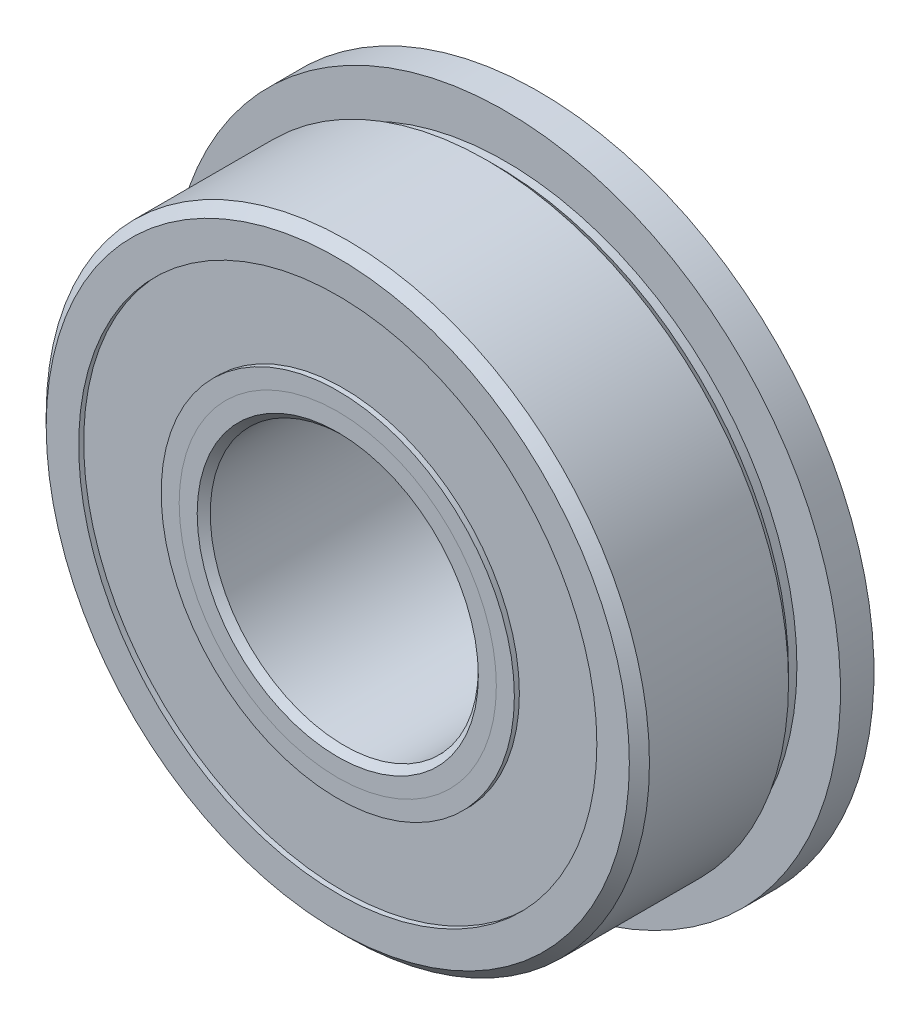
ISO-10303-21;
HEADER;
FILE_DESCRIPTION(('STEP AP214'),'2;1');
FILE_NAME('part.step','',(''),(''),'','','');
FILE_SCHEMA(('AUTOMOTIVE_DESIGN { 1 0 10303 214 1 1 1 1 }'));
ENDSEC;
DATA;
#1=APPLICATION_CONTEXT('core data for automotive mechanical design processes');
#2=APPLICATION_PROTOCOL_DEFINITION('international standard','automotive_design',2000,#1);
#3=PRODUCT_CONTEXT('',#1,'mechanical');
#4=PRODUCT('Part','Part','',(#3));
#5=PRODUCT_RELATED_PRODUCT_CATEGORY('part','',(#4));
#6=PRODUCT_DEFINITION_FORMATION('','',#4);
#7=PRODUCT_DEFINITION_CONTEXT('part definition',#1,'design');
#8=PRODUCT_DEFINITION('design','',#6,#7);
#9=PRODUCT_DEFINITION_SHAPE('','',#8);
#10=(LENGTH_UNIT() NAMED_UNIT(*) SI_UNIT(.MILLI.,.METRE.));
#11=(NAMED_UNIT(*) PLANE_ANGLE_UNIT() SI_UNIT($,.RADIAN.));
#12=(NAMED_UNIT(*) SI_UNIT($,.STERADIAN.) SOLID_ANGLE_UNIT());
#13=UNCERTAINTY_MEASURE_WITH_UNIT(LENGTH_MEASURE(1.E-05),#10,'distance_accuracy_value','');
#14=(GEOMETRIC_REPRESENTATION_CONTEXT(3) GLOBAL_UNCERTAINTY_ASSIGNED_CONTEXT((#13)) GLOBAL_UNIT_ASSIGNED_CONTEXT((#10,
#11,#12)) REPRESENTATION_CONTEXT('',''));
#15=CARTESIAN_POINT('',(0.,0.,0.));
#16=DIRECTION('',(0.,0.,1.));
#17=DIRECTION('',(1.,0.,0.));
#18=AXIS2_PLACEMENT_3D('',#15,#16,#17);
#19=CARTESIAN_POINT('',(0.,0.,4.7625));
#20=DIRECTION('',(0.,0.,1.));
#21=DIRECTION('',(1.,0.,0.));
#22=AXIS2_PLACEMENT_3D('',#19,#20,#21);
#23=CYLINDRICAL_SURFACE('',#22,8.7376);
#24=CARTESIAN_POINT('',(0.,0.,-3.35017734788581));
#25=DIRECTION('',(0.,0.,1.));
#26=DIRECTION('',(1.,0.,0.));
#27=AXIS2_PLACEMENT_3D('',#24,#25,#26);
#28=CIRCLE('',#27,8.7376);
#29=CARTESIAN_POINT('',(8.7376,0.,-3.35017734788581));
#30=VERTEX_POINT('',#29);
#31=EDGE_CURVE('E11',#30,#30,#28,.T.);
#32=ORIENTED_EDGE('',*,*,#31,.T.);
#33=EDGE_LOOP('',(#32));
#34=FACE_BOUND('',#33,.T.);
#35=CARTESIAN_POINT('',(0.,0.,-4.270375));
#36=DIRECTION('',(0.,0.,-1.));
#37=DIRECTION('',(-1.,0.,0.));
#38=AXIS2_PLACEMENT_3D('',#35,#36,#37);
#39=CIRCLE('',#38,8.7376);
#40=CARTESIAN_POINT('',(-8.7376,0.,-4.270375));
#41=VERTEX_POINT('',#40);
#42=EDGE_CURVE('E75',#41,#41,#39,.T.);
#43=ORIENTED_EDGE('',*,*,#42,.T.);
#44=EDGE_LOOP('',(#43));
#45=FACE_BOUND('',#44,.T.);
#46=ADVANCED_FACE('F54',(#34,#45),#23,.F.);
#47=CARTESIAN_POINT('',(0.,12.2725961538462,-4.524375));
#48=DIRECTION('',(0.,0.,1.));
#49=DIRECTION('',(1.,0.,0.));
#50=AXIS2_PLACEMENT_3D('',#47,#48,#49);
#51=PLANE('',#50);
#52=CARTESIAN_POINT('',(0.,0.,-4.524375));
#53=DIRECTION('',(0.,0.,-1.));
#54=DIRECTION('',(-1.,0.,0.));
#55=AXIS2_PLACEMENT_3D('',#52,#53,#54);
#56=CIRCLE('',#55,9.436608);
#57=CARTESIAN_POINT('',(-9.436608,0.,-4.524375));
#58=VERTEX_POINT('',#57);
#59=EDGE_CURVE('E72',#58,#58,#56,.T.);
#60=ORIENTED_EDGE('',*,*,#59,.F.);
#61=EDGE_LOOP('',(#60));
#62=FACE_BOUND('',#61,.T.);
#63=CARTESIAN_POINT('',(0.,0.,-4.524375));
#64=DIRECTION('',(0.,0.,1.));
#65=DIRECTION('',(1.,0.,0.));
#66=AXIS2_PLACEMENT_3D('',#63,#64,#65);
#67=CIRCLE('',#66,12.2725961538462);
#68=CARTESIAN_POINT('',(12.2725961538462,0.,-4.524375));
#69=VERTEX_POINT('',#68);
#70=EDGE_CURVE('E65',#69,#69,#67,.T.);
#71=ORIENTED_EDGE('',*,*,#70,.F.);
#72=EDGE_LOOP('',(#71));
#73=FACE_BOUND('',#72,.T.);
#74=ADVANCED_FACE('F56',(#62,#73),#51,.F.);
#75=CARTESIAN_POINT('',(0.,12.2725961538462,-3.35017734788581));
#76=DIRECTION('',(0.,0.,-1.));
#77=DIRECTION('',(-1.,0.,0.));
#78=AXIS2_PLACEMENT_3D('',#75,#76,#77);
#79=PLANE('',#78);
#80=ORIENTED_EDGE('',*,*,#31,.F.);
#81=EDGE_LOOP('',(#80));
#82=FACE_BOUND('',#81,.T.);
#83=CARTESIAN_POINT('',(0.,0.,-3.35017734788581));
#84=DIRECTION('',(0.,0.,1.));
#85=DIRECTION('',(1.,0.,0.));
#86=AXIS2_PLACEMENT_3D('',#83,#84,#85);
#87=CIRCLE('',#86,12.2725961538462);
#88=CARTESIAN_POINT('',(12.2725961538462,0.,-3.35017734788581));
#89=VERTEX_POINT('',#88);
#90=EDGE_CURVE('E61',#89,#89,#87,.T.);
#91=ORIENTED_EDGE('',*,*,#90,.T.);
#92=EDGE_LOOP('',(#91));
#93=FACE_BOUND('',#92,.T.);
#94=ADVANCED_FACE('F97',(#82,#93),#79,.F.);
#95=CARTESIAN_POINT('',(0.,0.,4.7625));
#96=DIRECTION('',(0.,0.,1.));
#97=DIRECTION('',(1.,0.,0.));
#98=AXIS2_PLACEMENT_3D('',#95,#96,#97);
#99=CYLINDRICAL_SURFACE('',#98,12.2725961538462);
#100=ORIENTED_EDGE('',*,*,#90,.F.);
#101=EDGE_LOOP('',(#100));
#102=FACE_BOUND('',#101,.T.);
#103=ORIENTED_EDGE('',*,*,#70,.T.);
#104=EDGE_LOOP('',(#103));
#105=FACE_BOUND('',#104,.T.);
#106=ADVANCED_FACE('F91',(#102,#105),#99,.T.);
#107=CARTESIAN_POINT('',(0.,0.,-4.270375));
#108=DIRECTION('',(0.,0.,-1.));
#109=DIRECTION('',(-1.,0.,0.));
#110=AXIS2_PLACEMENT_3D('',#107,#108,#109);
#111=CYLINDRICAL_SURFACE('',#110,9.436608);
#112=CARTESIAN_POINT('',(0.,0.,-4.270375));
#113=DIRECTION('',(0.,0.,-1.));
#114=DIRECTION('',(-1.,0.,0.));
#115=AXIS2_PLACEMENT_3D('',#112,#113,#114);
#116=CIRCLE('',#115,9.436608);
#117=CARTESIAN_POINT('',(-9.436608,0.,-4.270375));
#118=VERTEX_POINT('',#117);
#119=EDGE_CURVE('E69',#118,#118,#116,.T.);
#120=ORIENTED_EDGE('',*,*,#119,.F.);
#121=EDGE_LOOP('',(#120));
#122=FACE_BOUND('',#121,.T.);
#123=ORIENTED_EDGE('',*,*,#59,.T.);
#124=EDGE_LOOP('',(#123));
#125=FACE_BOUND('',#124,.T.);
#126=ADVANCED_FACE('F85',(#122,#125),#111,.F.);
#127=CARTESIAN_POINT('',(0.,0.,-4.270375));
#128=DIRECTION('',(0.,0.,-1.));
#129=DIRECTION('',(-1.,0.,0.));
#130=AXIS2_PLACEMENT_3D('',#127,#128,#129);
#131=PLANE('',#130);
#132=ORIENTED_EDGE('',*,*,#42,.F.);
#133=EDGE_LOOP('',(#132));
#134=FACE_BOUND('',#133,.T.);
#135=ORIENTED_EDGE('',*,*,#119,.T.);
#136=EDGE_LOOP('',(#135));
#137=FACE_BOUND('',#136,.T.);
#138=ADVANCED_FACE('F82',(#134,#137),#131,.T.);
#139=CLOSED_SHELL('',(#46,#74,#94,#106,#126,#138));
#140=MANIFOLD_SOLID_BREP('B2',#139);
#141=CARTESIAN_POINT('',(0.,12.2725961538462,4.524375));
#142=DIRECTION('',(0.,0.,-1.));
#143=DIRECTION('',(-1.,0.,0.));
#144=AXIS2_PLACEMENT_3D('',#141,#142,#143);
#145=PLANE('',#144);
#146=CARTESIAN_POINT('',(0.,0.,4.524375));
#147=DIRECTION('',(0.,0.,1.));
#148=DIRECTION('',(1.,0.,0.));
#149=AXIS2_PLACEMENT_3D('',#146,#147,#148);
#150=CIRCLE('',#149,8.36490384615385);
#151=CARTESIAN_POINT('',(8.36490384615385,0.,4.524375));
#152=VERTEX_POINT('',#151);
#153=EDGE_CURVE('E53',#152,#152,#150,.T.);
#154=ORIENTED_EDGE('',*,*,#153,.F.);
#155=EDGE_LOOP('',(#154));
#156=FACE_BOUND('',#155,.T.);
#157=CARTESIAN_POINT('',(0.,0.,4.524375));
#158=DIRECTION('',(0.,0.,1.));
#159=DIRECTION('',(1.,0.,0.));
#160=AXIS2_PLACEMENT_3D('',#157,#158,#159);
#161=CIRCLE('',#160,12.2725961538462);
#162=CARTESIAN_POINT('',(12.2725961538462,0.,4.524375));
#163=VERTEX_POINT('',#162);
#164=EDGE_CURVE('E175',#163,#163,#161,.T.);
#165=ORIENTED_EDGE('',*,*,#164,.T.);
#166=EDGE_LOOP('',(#165));
#167=FACE_BOUND('',#166,.T.);
#168=ADVANCED_FACE('F161',(#156,#167),#145,.F.);
#169=CARTESIAN_POINT('',(0.,0.,4.7625));
#170=DIRECTION('',(0.,0.,1.));
#171=DIRECTION('',(1.,0.,0.));
#172=AXIS2_PLACEMENT_3D('',#169,#170,#171);
#173=CYLINDRICAL_SURFACE('',#172,8.36490384615385);
#174=CARTESIAN_POINT('',(0.,0.,3.3501773478858));
#175=DIRECTION('',(0.,0.,1.));
#176=DIRECTION('',(1.,0.,0.));
#177=AXIS2_PLACEMENT_3D('',#174,#175,#176);
#178=CIRCLE('',#177,8.36490384615385);
#179=CARTESIAN_POINT('',(8.36490384615385,0.,3.3501773478858));
#180=VERTEX_POINT('',#179);
#181=EDGE_CURVE('E167',#180,#180,#178,.T.);
#182=ORIENTED_EDGE('',*,*,#181,.F.);
#183=EDGE_LOOP('',(#182));
#184=FACE_BOUND('',#183,.T.);
#185=ORIENTED_EDGE('',*,*,#153,.T.);
#186=EDGE_LOOP('',(#185));
#187=FACE_BOUND('',#186,.T.);
#188=ADVANCED_FACE('F190',(#184,#187),#173,.F.);
#189=CARTESIAN_POINT('',(0.,12.2725961538462,3.3501773478858));
#190=DIRECTION('',(0.,0.,1.));
#191=DIRECTION('',(1.,0.,0.));
#192=AXIS2_PLACEMENT_3D('',#189,#190,#191);
#193=PLANE('',#192);
#194=CARTESIAN_POINT('',(0.,0.,3.35017734788581));
#195=DIRECTION('',(0.,0.,1.));
#196=DIRECTION('',(1.,0.,0.));
#197=AXIS2_PLACEMENT_3D('',#194,#195,#196);
#198=CIRCLE('',#197,12.2725961538462);
#199=CARTESIAN_POINT('',(12.2725961538462,0.,3.35017734788581));
#200=VERTEX_POINT('',#199);
#201=EDGE_CURVE('E171',#200,#200,#198,.T.);
#202=ORIENTED_EDGE('',*,*,#201,.F.);
#203=EDGE_LOOP('',(#202));
#204=FACE_BOUND('',#203,.T.);
#205=ORIENTED_EDGE('',*,*,#181,.T.);
#206=EDGE_LOOP('',(#205));
#207=FACE_BOUND('',#206,.T.);
#208=ADVANCED_FACE('F185',(#204,#207),#193,.F.);
#209=CARTESIAN_POINT('',(0.,0.,4.7625));
#210=DIRECTION('',(0.,0.,1.));
#211=DIRECTION('',(1.,0.,0.));
#212=AXIS2_PLACEMENT_3D('',#209,#210,#211);
#213=CYLINDRICAL_SURFACE('',#212,12.2725961538462);
#214=ORIENTED_EDGE('',*,*,#164,.F.);
#215=EDGE_LOOP('',(#214));
#216=FACE_BOUND('',#215,.T.);
#217=ORIENTED_EDGE('',*,*,#201,.T.);
#218=EDGE_LOOP('',(#217));
#219=FACE_BOUND('',#218,.T.);
#220=ADVANCED_FACE('F182',(#216,#219),#213,.T.);
#221=CLOSED_SHELL('',(#168,#188,#208,#220));
#222=MANIFOLD_SOLID_BREP('B6',#221);
#223=CARTESIAN_POINT('',(-5.15937499999989,8.93629963530074,0.));
#224=DIRECTION('',(0.,0.,1.));
#225=DIRECTION('',(-0.499999999999989,0.866025403784445,0.));
#226=AXIS2_PLACEMENT_3D('',#223,#224,#225);
#227=SPHERICAL_SURFACE('',#226,3.3501773478858);
#228=CARTESIAN_POINT('',(-5.15937499999989,8.93629963530074,3.3501773478858));
#229=VERTEX_POINT('',#228);
#230=VERTEX_LOOP('',#229);
#231=FACE_BOUND('',#230,.T.);
#232=ADVANCED_FACE('F221',(#231),#227,.T.);
#233=CLOSED_SHELL('',(#232));
#234=MANIFOLD_SOLID_BREP('B48',#233);
#235=CARTESIAN_POINT('',(-8.93629963530062,5.1593750000001,0.));
#236=DIRECTION('',(0.,0.,1.));
#237=DIRECTION('',(-0.866025403784433,0.50000000000001,0.));
#238=AXIS2_PLACEMENT_3D('',#235,#236,#237);
#239=SPHERICAL_SURFACE('',#238,3.3501773478858);
#240=CARTESIAN_POINT('',(-8.93629963530062,5.1593750000001,3.3501773478858));
#241=VERTEX_POINT('',#240);
#242=VERTEX_LOOP('',#241);
#243=FACE_BOUND('',#242,.T.);
#244=ADVANCED_FACE('F240',(#243),#239,.T.);
#245=CLOSED_SHELL('',(#244));
#246=MANIFOLD_SOLID_BREP('B157',#245);
#247=CARTESIAN_POINT('',(-10.31875,1.08083169195563E-13,0.));
#248=DIRECTION('',(0.,0.,1.));
#249=DIRECTION('',(-1.,0.,0.));
#250=AXIS2_PLACEMENT_3D('',#247,#248,#249);
#251=SPHERICAL_SURFACE('',#250,3.3501773478858);
#252=CARTESIAN_POINT('',(-10.31875,1.08083169195563E-13,3.3501773478858));
#253=VERTEX_POINT('',#252);
#254=VERTEX_LOOP('',#253);
#255=FACE_BOUND('',#254,.T.);
#256=ADVANCED_FACE('F259',(#255),#251,.T.);
#257=CLOSED_SHELL('',(#256));
#258=MANIFOLD_SOLID_BREP('B217',#257);
#259=CARTESIAN_POINT('',(-8.93629963530072,-5.15937499999992,0.));
#260=DIRECTION('',(0.,0.,1.));
#261=DIRECTION('',(-0.866025403784443,-0.499999999999992,0.));
#262=AXIS2_PLACEMENT_3D('',#259,#260,#261);
#263=SPHERICAL_SURFACE('',#262,3.3501773478858);
#264=CARTESIAN_POINT('',(-8.93629963530072,-5.15937499999992,3.3501773478858));
#265=VERTEX_POINT('',#264);
#266=VERTEX_LOOP('',#265);
#267=FACE_BOUND('',#266,.T.);
#268=ADVANCED_FACE('F278',(#267),#263,.T.);
#269=CLOSED_SHELL('',(#268));
#270=MANIFOLD_SOLID_BREP('B236',#269);
#271=CARTESIAN_POINT('',(-5.15937500000007,-8.93629963530064,0.));
#272=DIRECTION('',(0.,0.,1.));
#273=DIRECTION('',(-0.500000000000007,-0.866025403784435,0.));
#274=AXIS2_PLACEMENT_3D('',#271,#272,#273);
#275=SPHERICAL_SURFACE('',#274,3.3501773478858);
#276=CARTESIAN_POINT('',(-5.15937500000007,-8.93629963530064,3.3501773478858));
#277=VERTEX_POINT('',#276);
#278=VERTEX_LOOP('',#277);
#279=FACE_BOUND('',#278,.T.);
#280=ADVANCED_FACE('F297',(#279),#275,.T.);
#281=CLOSED_SHELL('',(#280));
#282=MANIFOLD_SOLID_BREP('B255',#281);
#283=CARTESIAN_POINT('',(0.,-10.31875,0.));
#284=DIRECTION('',(0.,0.,1.));
#285=DIRECTION('',(0.,-1.,0.));
#286=AXIS2_PLACEMENT_3D('',#283,#284,#285);
#287=SPHERICAL_SURFACE('',#286,3.3501773478858);
#288=CARTESIAN_POINT('',(0.,-10.31875,3.3501773478858));
#289=VERTEX_POINT('',#288);
#290=VERTEX_LOOP('',#289);
#291=FACE_BOUND('',#290,.T.);
#292=ADVANCED_FACE('F316',(#291),#287,.T.);
#293=CLOSED_SHELL('',(#292));
#294=MANIFOLD_SOLID_BREP('B274',#293);
#295=CARTESIAN_POINT('',(5.15937499999995,-8.93629963530071,0.));
#296=DIRECTION('',(0.,0.,1.));
#297=DIRECTION('',(0.499999999999995,-0.866025403784442,0.));
#298=AXIS2_PLACEMENT_3D('',#295,#296,#297);
#299=SPHERICAL_SURFACE('',#298,3.3501773478858);
#300=CARTESIAN_POINT('',(5.15937499999995,-8.93629963530071,3.3501773478858));
#301=VERTEX_POINT('',#300);
#302=VERTEX_LOOP('',#301);
#303=FACE_BOUND('',#302,.T.);
#304=ADVANCED_FACE('F335',(#303),#299,.T.);
#305=CLOSED_SHELL('',(#304));
#306=MANIFOLD_SOLID_BREP('B293',#305);
#307=CARTESIAN_POINT('',(8.93629963530065,-5.15937500000004,0.));
#308=DIRECTION('',(0.,0.,1.));
#309=DIRECTION('',(0.866025403784436,-0.500000000000004,0.));
#310=AXIS2_PLACEMENT_3D('',#307,#308,#309);
#311=SPHERICAL_SURFACE('',#310,3.3501773478858);
#312=CARTESIAN_POINT('',(8.93629963530065,-5.15937500000004,3.3501773478858));
#313=VERTEX_POINT('',#312);
#314=VERTEX_LOOP('',#313);
#315=FACE_BOUND('',#314,.T.);
#316=ADVANCED_FACE('F354',(#315),#311,.T.);
#317=CLOSED_SHELL('',(#316));
#318=MANIFOLD_SOLID_BREP('B312',#317);
#319=CARTESIAN_POINT('',(10.31875,0.,0.));
#320=DIRECTION('',(0.,0.,1.));
#321=DIRECTION('',(1.,0.,0.));
#322=AXIS2_PLACEMENT_3D('',#319,#320,#321);
#323=SPHERICAL_SURFACE('',#322,3.3501773478858);
#324=CARTESIAN_POINT('',(10.31875,0.,3.3501773478858));
#325=VERTEX_POINT('',#324);
#326=VERTEX_LOOP('',#325);
#327=FACE_BOUND('',#326,.T.);
#328=ADVANCED_FACE('F373',(#327),#323,.T.);
#329=CLOSED_SHELL('',(#328));
#330=MANIFOLD_SOLID_BREP('B331',#329);
#331=CARTESIAN_POINT('',(8.93629963530069,5.15937499999998,0.));
#332=DIRECTION('',(0.,0.,1.));
#333=DIRECTION('',(0.86602540378444,0.499999999999998,0.));
#334=AXIS2_PLACEMENT_3D('',#331,#332,#333);
#335=SPHERICAL_SURFACE('',#334,3.3501773478858);
#336=CARTESIAN_POINT('',(8.93629963530069,5.15937499999998,3.3501773478858));
#337=VERTEX_POINT('',#336);
#338=VERTEX_LOOP('',#337);
#339=FACE_BOUND('',#338,.T.);
#340=ADVANCED_FACE('F392',(#339),#335,.T.);
#341=CLOSED_SHELL('',(#340));
#342=MANIFOLD_SOLID_BREP('B350',#341);
#343=CARTESIAN_POINT('',(5.15937500000001,8.93629963530067,0.));
#344=DIRECTION('',(0.,0.,1.));
#345=DIRECTION('',(0.500000000000001,0.866025403784438,0.));
#346=AXIS2_PLACEMENT_3D('',#343,#344,#345);
#347=SPHERICAL_SURFACE('',#346,3.3501773478858);
#348=CARTESIAN_POINT('',(5.15937500000001,8.93629963530067,3.3501773478858));
#349=VERTEX_POINT('',#348);
#350=VERTEX_LOOP('',#349);
#351=FACE_BOUND('',#350,.T.);
#352=ADVANCED_FACE('F411',(#351),#347,.T.);
#353=CLOSED_SHELL('',(#352));
#354=MANIFOLD_SOLID_BREP('B369',#353);
#355=CARTESIAN_POINT('',(0.,10.31875,0.));
#356=DIRECTION('',(0.,0.,1.));
#357=DIRECTION('',(0.,1.,0.));
#358=AXIS2_PLACEMENT_3D('',#355,#356,#357);
#359=SPHERICAL_SURFACE('',#358,3.3501773478858);
#360=CARTESIAN_POINT('',(0.,10.31875,3.3501773478858));
#361=VERTEX_POINT('',#360);
#362=VERTEX_LOOP('',#361);
#363=FACE_BOUND('',#362,.T.);
#364=ADVANCED_FACE('F432',(#363),#359,.T.);
#365=CLOSED_SHELL('',(#364));
#366=MANIFOLD_SOLID_BREP('B388',#365);
#367=CARTESIAN_POINT('',(0.,6.82625,-6.35));
#368=DIRECTION('',(0.,0.,1.));
#369=DIRECTION('',(1.,0.,0.));
#370=AXIS2_PLACEMENT_3D('',#367,#368,#369);
#371=PLANE('',#370);
#372=CARTESIAN_POINT('',(0.,0.,-6.35));
#373=DIRECTION('',(0.,0.,1.));
#374=DIRECTION('',(1.,0.,0.));
#375=AXIS2_PLACEMENT_3D('',#372,#373,#374);
#376=CIRCLE('',#375,6.82625);
#377=CARTESIAN_POINT('',(6.82625,0.,-6.35));
#378=VERTEX_POINT('',#377);
#379=EDGE_CURVE('E477',#378,#378,#376,.T.);
#380=ORIENTED_EDGE('',*,*,#379,.T.);
#381=EDGE_LOOP('',(#380));
#382=FACE_BOUND('',#381,.T.);
#383=CARTESIAN_POINT('',(0.,0.,-6.35));
#384=DIRECTION('',(0.,0.,-1.));
#385=DIRECTION('',(-1.,0.,0.));
#386=AXIS2_PLACEMENT_3D('',#383,#384,#385);
#387=CIRCLE('',#386,7.607173);
#388=CARTESIAN_POINT('',(-7.607173,0.,-6.35));
#389=VERTEX_POINT('',#388);
#390=EDGE_CURVE('E496',#389,#389,#387,.T.);
#391=ORIENTED_EDGE('',*,*,#390,.T.);
#392=EDGE_LOOP('',(#391));
#393=FACE_BOUND('',#392,.T.);
#394=ADVANCED_FACE('F451',(#382,#393),#371,.F.);
#395=CARTESIAN_POINT('',(0.,7.51209508610547,4.7625));
#396=DIRECTION('',(0.,0.,-1.));
#397=DIRECTION('',(-1.,0.,0.));
#398=AXIS2_PLACEMENT_3D('',#395,#396,#397);
#399=PLANE('',#398);
#400=CARTESIAN_POINT('',(0.,0.,4.7625));
#401=DIRECTION('',(0.,0.,1.));
#402=DIRECTION('',(1.,0.,0.));
#403=AXIS2_PLACEMENT_3D('',#400,#401,#402);
#404=CIRCLE('',#403,6.6592863260571);
#405=CARTESIAN_POINT('',(6.6592863260571,0.,4.7625));
#406=VERTEX_POINT('',#405);
#407=EDGE_CURVE('E486',#406,#406,#404,.T.);
#408=ORIENTED_EDGE('',*,*,#407,.F.);
#409=EDGE_LOOP('',(#408));
#410=FACE_BOUND('',#409,.T.);
#411=CARTESIAN_POINT('',(0.,0.,4.7625));
#412=DIRECTION('',(0.,0.,1.));
#413=DIRECTION('',(1.,0.,0.));
#414=AXIS2_PLACEMENT_3D('',#411,#412,#413);
#415=CIRCLE('',#414,7.51209508610547);
#416=CARTESIAN_POINT('',(7.51209508610547,0.,4.7625));
#417=VERTEX_POINT('',#416);
#418=EDGE_CURVE('E431',#417,#417,#415,.T.);
#419=ORIENTED_EDGE('',*,*,#418,.T.);
#420=EDGE_LOOP('',(#419));
#421=FACE_BOUND('',#420,.T.);
#422=ADVANCED_FACE('F453',(#410,#421),#399,.F.);
#423=CARTESIAN_POINT('',(0.,0.,3.90969123995163));
#424=DIRECTION('',(0.,0.,1.));
#425=DIRECTION('',(1.,0.,0.));
#426=AXIS2_PLACEMENT_3D('',#423,#424,#425);
#427=CONICAL_SURFACE('',#426,6.6592863260571,0.785398163397449);
#428=ORIENTED_EDGE('',*,*,#418,.F.);
#429=EDGE_LOOP('',(#428));
#430=FACE_BOUND('',#429,.T.);
#431=CARTESIAN_POINT('',(0.,0.,3.90969123995163));
#432=DIRECTION('',(0.,0.,1.));
#433=DIRECTION('',(1.,0.,0.));
#434=AXIS2_PLACEMENT_3D('',#431,#432,#433);
#435=CIRCLE('',#434,6.6592863260571);
#436=CARTESIAN_POINT('',(6.6592863260571,0.,3.90969123995163));
#437=VERTEX_POINT('',#436);
#438=EDGE_CURVE('E458',#437,#437,#435,.T.);
#439=ORIENTED_EDGE('',*,*,#438,.T.);
#440=EDGE_LOOP('',(#439));
#441=FACE_BOUND('',#440,.T.);
#442=ADVANCED_FACE('F544',(#430,#441),#427,.T.);
#443=CARTESIAN_POINT('',(0.,0.,4.7625));
#444=DIRECTION('',(0.,0.,1.));
#445=DIRECTION('',(1.,0.,0.));
#446=AXIS2_PLACEMENT_3D('',#443,#444,#445);
#447=CYLINDRICAL_SURFACE('',#446,6.6592863260571);
#448=ORIENTED_EDGE('',*,*,#438,.F.);
#449=EDGE_LOOP('',(#448));
#450=FACE_BOUND('',#449,.T.);
#451=CARTESIAN_POINT('',(0.,0.,0.));
#452=DIRECTION('',(0.,0.,1.));
#453=DIRECTION('',(1.,0.,0.));
#454=AXIS2_PLACEMENT_3D('',#451,#452,#453);
#455=CIRCLE('',#454,6.6592863260571);
#456=CARTESIAN_POINT('',(6.6592863260571,0.,0.));
#457=VERTEX_POINT('',#456);
#458=EDGE_CURVE('E462',#457,#457,#455,.T.);
#459=ORIENTED_EDGE('',*,*,#458,.T.);
#460=EDGE_LOOP('',(#459));
#461=FACE_BOUND('',#460,.T.);
#462=ADVANCED_FACE('F598',(#450,#461),#447,.T.);
#463=CARTESIAN_POINT('',(0.,6.6592863260571,0.));
#464=DIRECTION('',(0.,0.,-1.));
#465=DIRECTION('',(-1.,0.,0.));
#466=AXIS2_PLACEMENT_3D('',#463,#464,#465);
#467=PLANE('',#466);
#468=ORIENTED_EDGE('',*,*,#458,.F.);
#469=EDGE_LOOP('',(#468));
#470=FACE_BOUND('',#469,.T.);
#471=CARTESIAN_POINT('',(0.,0.,0.));
#472=DIRECTION('',(0.,0.,1.));
#473=DIRECTION('',(1.,0.,0.));
#474=AXIS2_PLACEMENT_3D('',#471,#472,#473);
#475=CIRCLE('',#474,6.9685726521142);
#476=CARTESIAN_POINT('',(6.9685726521142,0.,0.));
#477=VERTEX_POINT('',#476);
#478=EDGE_CURVE('E466',#477,#477,#475,.T.);
#479=ORIENTED_EDGE('',*,*,#478,.T.);
#480=EDGE_LOOP('',(#479));
#481=FACE_BOUND('',#480,.T.);
#482=ADVANCED_FACE('F534',(#470,#481),#467,.F.);
#483=CARTESIAN_POINT('',(0.,0.,0.));
#484=DIRECTION('',(0.,0.,1.));
#485=DIRECTION('',(1.,0.,0.));
#486=AXIS2_PLACEMENT_3D('',#483,#484,#485);
#487=TOROIDAL_SURFACE('',#486,10.31875,3.3501773478858);
#488=ORIENTED_EDGE('',*,*,#478,.F.);
#489=EDGE_LOOP('',(#488));
#490=FACE_BOUND('',#489,.T.);
#491=CARTESIAN_POINT('',(0.,0.,-2.9535830680357));
#492=DIRECTION('',(0.,0.,1.));
#493=DIRECTION('',(1.,0.,0.));
#494=AXIS2_PLACEMENT_3D('',#491,#492,#493);
#495=CIRCLE('',#494,8.7376);
#496=CARTESIAN_POINT('',(8.7376,0.,-2.9535830680357));
#497=VERTEX_POINT('',#496);
#498=EDGE_CURVE('E471',#497,#497,#495,.T.);
#499=ORIENTED_EDGE('',*,*,#498,.T.);
#500=EDGE_LOOP('',(#499));
#501=FACE_BOUND('',#500,.T.);
#502=ADVANCED_FACE('F527',(#490,#501),#487,.F.);
#503=CARTESIAN_POINT('',(0.,0.,4.7625));
#504=DIRECTION('',(0.,0.,1.));
#505=DIRECTION('',(1.,0.,0.));
#506=AXIS2_PLACEMENT_3D('',#503,#504,#505);
#507=CYLINDRICAL_SURFACE('',#506,8.7376);
#508=ORIENTED_EDGE('',*,*,#498,.F.);
#509=EDGE_LOOP('',(#508));
#510=FACE_BOUND('',#509,.T.);
#511=CARTESIAN_POINT('',(0.,0.,-6.35));
#512=DIRECTION('',(0.,0.,1.));
#513=DIRECTION('',(1.,0.,0.));
#514=AXIS2_PLACEMENT_3D('',#511,#512,#513);
#515=CIRCLE('',#514,8.7376);
#516=CARTESIAN_POINT('',(8.7376,0.,-6.35));
#517=VERTEX_POINT('',#516);
#518=EDGE_CURVE('E474',#517,#517,#515,.T.);
#519=ORIENTED_EDGE('',*,*,#518,.T.);
#520=EDGE_LOOP('',(#519));
#521=FACE_BOUND('',#520,.T.);
#522=ADVANCED_FACE('F522',(#510,#521),#507,.T.);
#523=CARTESIAN_POINT('',(0.,0.,-6.35));
#524=DIRECTION('',(0.,0.,-1.));
#525=DIRECTION('',(-1.,0.,0.));
#526=AXIS2_PLACEMENT_3D('',#523,#524,#525);
#527=CIRCLE('',#526,7.956677);
#528=CARTESIAN_POINT('',(-7.956677,0.,-6.35));
#529=VERTEX_POINT('',#528);
#530=EDGE_CURVE('E490',#529,#529,#527,.T.);
#531=ORIENTED_EDGE('',*,*,#530,.F.);
#532=EDGE_LOOP('',(#531));
#533=FACE_BOUND('',#532,.T.);
#534=ORIENTED_EDGE('',*,*,#518,.F.);
#535=EDGE_LOOP('',(#534));
#536=FACE_BOUND('',#535,.T.);
#537=ADVANCED_FACE('F518',(#533,#536),#371,.F.);
#538=CARTESIAN_POINT('',(0.,0.,-5.87375));
#539=DIRECTION('',(0.,0.,-1.));
#540=DIRECTION('',(-1.,0.,0.));
#541=AXIS2_PLACEMENT_3D('',#538,#539,#540);
#542=CONICAL_SURFACE('',#541,6.35,0.785398163397445);
#543=ORIENTED_EDGE('',*,*,#379,.F.);
#544=EDGE_LOOP('',(#543));
#545=FACE_BOUND('',#544,.T.);
#546=CARTESIAN_POINT('',(0.,0.,-5.87375));
#547=DIRECTION('',(0.,0.,1.));
#548=DIRECTION('',(1.,0.,0.));
#549=AXIS2_PLACEMENT_3D('',#546,#547,#548);
#550=CIRCLE('',#549,6.35);
#551=CARTESIAN_POINT('',(6.35,0.,-5.87375));
#552=VERTEX_POINT('',#551);
#553=EDGE_CURVE('E480',#552,#552,#550,.T.);
#554=ORIENTED_EDGE('',*,*,#553,.T.);
#555=EDGE_LOOP('',(#554));
#556=FACE_BOUND('',#555,.T.);
#557=ADVANCED_FACE('F521',(#545,#556),#542,.F.);
#558=CARTESIAN_POINT('',(0.,0.,4.7625));
#559=DIRECTION('',(0.,0.,1.));
#560=DIRECTION('',(1.,0.,0.));
#561=AXIS2_PLACEMENT_3D('',#558,#559,#560);
#562=CYLINDRICAL_SURFACE('',#561,6.35);
#563=ORIENTED_EDGE('',*,*,#553,.F.);
#564=EDGE_LOOP('',(#563));
#565=FACE_BOUND('',#564,.T.);
#566=CARTESIAN_POINT('',(0.,0.,4.4532136739429));
#567=DIRECTION('',(0.,0.,1.));
#568=DIRECTION('',(1.,0.,0.));
#569=AXIS2_PLACEMENT_3D('',#566,#567,#568);
#570=CIRCLE('',#569,6.35);
#571=CARTESIAN_POINT('',(6.35,0.,4.4532136739429));
#572=VERTEX_POINT('',#571);
#573=EDGE_CURVE('E483',#572,#572,#570,.T.);
#574=ORIENTED_EDGE('',*,*,#573,.T.);
#575=EDGE_LOOP('',(#574));
#576=FACE_BOUND('',#575,.T.);
#577=ADVANCED_FACE('F549',(#565,#576),#562,.F.);
#578=CARTESIAN_POINT('',(0.,0.,4.7625));
#579=DIRECTION('',(0.,0.,1.));
#580=DIRECTION('',(1.,0.,0.));
#581=AXIS2_PLACEMENT_3D('',#578,#579,#580);
#582=CONICAL_SURFACE('',#581,6.6592863260571,0.78539816339745);
#583=ORIENTED_EDGE('',*,*,#573,.F.);
#584=EDGE_LOOP('',(#583));
#585=FACE_BOUND('',#584,.T.);
#586=ORIENTED_EDGE('',*,*,#407,.T.);
#587=EDGE_LOOP('',(#586));
#588=FACE_BOUND('',#587,.T.);
#589=ADVANCED_FACE('F514',(#585,#588),#582,.F.);
#590=CARTESIAN_POINT('',(0.,0.,-6.223));
#591=DIRECTION('',(0.,0.,-1.));
#592=DIRECTION('',(-1.,0.,0.));
#593=AXIS2_PLACEMENT_3D('',#590,#591,#592);
#594=CYLINDRICAL_SURFACE('',#593,7.956677);
#595=CARTESIAN_POINT('',(0.,0.,-6.223));
#596=DIRECTION('',(0.,0.,-1.));
#597=DIRECTION('',(-1.,0.,0.));
#598=AXIS2_PLACEMENT_3D('',#595,#596,#597);
#599=CIRCLE('',#598,7.956677);
#600=CARTESIAN_POINT('',(-7.956677,0.,-6.223));
#601=VERTEX_POINT('',#600);
#602=EDGE_CURVE('E489',#601,#601,#599,.T.);
#603=ORIENTED_EDGE('',*,*,#602,.F.);
#604=EDGE_LOOP('',(#603));
#605=FACE_BOUND('',#604,.T.);
#606=ORIENTED_EDGE('',*,*,#530,.T.);
#607=EDGE_LOOP('',(#606));
#608=FACE_BOUND('',#607,.T.);
#609=ADVANCED_FACE('F508',(#605,#608),#594,.F.);
#610=CARTESIAN_POINT('',(0.,0.,-6.223));
#611=DIRECTION('',(0.,0.,-1.));
#612=DIRECTION('',(-1.,0.,0.));
#613=AXIS2_PLACEMENT_3D('',#610,#611,#612);
#614=PLANE('',#613);
#615=CARTESIAN_POINT('',(0.,0.,-6.223));
#616=DIRECTION('',(0.,0.,-1.));
#617=DIRECTION('',(-1.,0.,0.));
#618=AXIS2_PLACEMENT_3D('',#615,#616,#617);
#619=CIRCLE('',#618,7.607173);
#620=CARTESIAN_POINT('',(-7.607173,0.,-6.223));
#621=VERTEX_POINT('',#620);
#622=EDGE_CURVE('E493',#621,#621,#619,.T.);
#623=ORIENTED_EDGE('',*,*,#622,.F.);
#624=EDGE_LOOP('',(#623));
#625=FACE_BOUND('',#624,.T.);
#626=ORIENTED_EDGE('',*,*,#602,.T.);
#627=EDGE_LOOP('',(#626));
#628=FACE_BOUND('',#627,.T.);
#629=ADVANCED_FACE('F505',(#625,#628),#614,.T.);
#630=CARTESIAN_POINT('',(0.,0.,-6.223));
#631=DIRECTION('',(0.,0.,-1.));
#632=DIRECTION('',(-1.,0.,0.));
#633=AXIS2_PLACEMENT_3D('',#630,#631,#632);
#634=CYLINDRICAL_SURFACE('',#633,7.607173);
#635=ORIENTED_EDGE('',*,*,#622,.T.);
#636=EDGE_LOOP('',(#635));
#637=FACE_BOUND('',#636,.T.);
#638=ORIENTED_EDGE('',*,*,#390,.F.);
#639=EDGE_LOOP('',(#638));
#640=FACE_BOUND('',#639,.T.);
#641=ADVANCED_FACE('F502',(#637,#640),#634,.T.);
#642=CLOSED_SHELL('',(#394,#422,#442,#462,#482,#502,#522,#537,#557,#577,#589,#609,#629,#641));
#643=MANIFOLD_SOLID_BREP('B407',#642);
#644=CARTESIAN_POINT('',(0.,8.36490384615385,4.7625));
#645=DIRECTION('',(0.,0.,-1.));
#646=DIRECTION('',(-1.,0.,0.));
#647=AXIS2_PLACEMENT_3D('',#644,#645,#646);
#648=PLANE('',#647);
#649=CARTESIAN_POINT('',(0.,0.,4.7625));
#650=DIRECTION('',(0.,0.,1.));
#651=DIRECTION('',(1.,0.,0.));
#652=AXIS2_PLACEMENT_3D('',#649,#650,#651);
#653=CIRCLE('',#652,7.51209508610547);
#654=CARTESIAN_POINT('',(7.51209508610547,0.,4.7625));
#655=VERTEX_POINT('',#654);
#656=EDGE_CURVE('E450',#655,#655,#653,.T.);
#657=ORIENTED_EDGE('',*,*,#656,.F.);
#658=EDGE_LOOP('',(#657));
#659=FACE_BOUND('',#658,.T.);
#660=CARTESIAN_POINT('',(0.,0.,4.7625));
#661=DIRECTION('',(0.,0.,1.));
#662=DIRECTION('',(1.,0.,0.));
#663=AXIS2_PLACEMENT_3D('',#660,#661,#662);
#664=CIRCLE('',#663,8.36490384615385);
#665=CARTESIAN_POINT('',(8.36490384615385,0.,4.7625));
#666=VERTEX_POINT('',#665);
#667=EDGE_CURVE('E663',#666,#666,#664,.T.);
#668=ORIENTED_EDGE('',*,*,#667,.T.);
#669=EDGE_LOOP('',(#668));
#670=FACE_BOUND('',#669,.T.);
#671=ADVANCED_FACE('F641',(#659,#670),#648,.F.);
#672=CARTESIAN_POINT('',(0.,0.,4.7625));
#673=DIRECTION('',(0.,0.,1.));
#674=DIRECTION('',(1.,0.,0.));
#675=AXIS2_PLACEMENT_3D('',#672,#673,#674);
#676=CONICAL_SURFACE('',#675,7.51209508610547,0.785398163397449);
#677=CARTESIAN_POINT('',(0.,0.,3.90969123995163));
#678=DIRECTION('',(0.,0.,1.));
#679=DIRECTION('',(1.,0.,0.));
#680=AXIS2_PLACEMENT_3D('',#677,#678,#679);
#681=CIRCLE('',#680,6.6592863260571);
#682=CARTESIAN_POINT('',(6.6592863260571,0.,3.90969123995163));
#683=VERTEX_POINT('',#682);
#684=EDGE_CURVE('E647',#683,#683,#681,.T.);
#685=ORIENTED_EDGE('',*,*,#684,.F.);
#686=EDGE_LOOP('',(#685));
#687=FACE_BOUND('',#686,.T.);
#688=ORIENTED_EDGE('',*,*,#656,.T.);
#689=EDGE_LOOP('',(#688));
#690=FACE_BOUND('',#689,.T.);
#691=ADVANCED_FACE('F688',(#687,#690),#676,.F.);
#692=CARTESIAN_POINT('',(0.,0.,4.7625));
#693=DIRECTION('',(0.,0.,1.));
#694=DIRECTION('',(1.,0.,0.));
#695=AXIS2_PLACEMENT_3D('',#692,#693,#694);
#696=CYLINDRICAL_SURFACE('',#695,6.6592863260571);
#697=CARTESIAN_POINT('',(0.,0.,0.));
#698=DIRECTION('',(0.,0.,1.));
#699=DIRECTION('',(1.,0.,0.));
#700=AXIS2_PLACEMENT_3D('',#697,#698,#699);
#701=CIRCLE('',#700,6.6592863260571);
#702=CARTESIAN_POINT('',(6.6592863260571,0.,0.));
#703=VERTEX_POINT('',#702);
#704=EDGE_CURVE('E651',#703,#703,#701,.T.);
#705=ORIENTED_EDGE('',*,*,#704,.F.);
#706=EDGE_LOOP('',(#705));
#707=FACE_BOUND('',#706,.T.);
#708=ORIENTED_EDGE('',*,*,#684,.T.);
#709=EDGE_LOOP('',(#708));
#710=FACE_BOUND('',#709,.T.);
#711=ADVANCED_FACE('F683',(#707,#710),#696,.F.);
#712=CARTESIAN_POINT('',(0.,6.6592863260571,0.));
#713=DIRECTION('',(0.,0.,1.));
#714=DIRECTION('',(1.,0.,0.));
#715=AXIS2_PLACEMENT_3D('',#712,#713,#714);
#716=PLANE('',#715);
#717=CARTESIAN_POINT('',(0.,0.,0.));
#718=DIRECTION('',(0.,0.,1.));
#719=DIRECTION('',(1.,0.,0.));
#720=AXIS2_PLACEMENT_3D('',#717,#718,#719);
#721=CIRCLE('',#720,6.9685726521142);
#722=CARTESIAN_POINT('',(6.9685726521142,0.,0.));
#723=VERTEX_POINT('',#722);
#724=EDGE_CURVE('E655',#723,#723,#721,.T.);
#725=ORIENTED_EDGE('',*,*,#724,.F.);
#726=EDGE_LOOP('',(#725));
#727=FACE_BOUND('',#726,.T.);
#728=ORIENTED_EDGE('',*,*,#704,.T.);
#729=EDGE_LOOP('',(#728));
#730=FACE_BOUND('',#729,.T.);
#731=ADVANCED_FACE('F677',(#727,#730),#716,.F.);
#732=CARTESIAN_POINT('',(0.,0.,0.));
#733=DIRECTION('',(0.,0.,1.));
#734=DIRECTION('',(1.,0.,0.));
#735=AXIS2_PLACEMENT_3D('',#732,#733,#734);
#736=TOROIDAL_SURFACE('',#735,10.31875,3.3501773478858);
#737=CARTESIAN_POINT('',(0.,0.,2.72142857142857));
#738=DIRECTION('',(0.,0.,1.));
#739=DIRECTION('',(1.,0.,0.));
#740=AXIS2_PLACEMENT_3D('',#737,#738,#739);
#741=CIRCLE('',#740,8.36490384615385);
#742=CARTESIAN_POINT('',(8.36490384615385,0.,2.72142857142857));
#743=VERTEX_POINT('',#742);
#744=EDGE_CURVE('E660',#743,#743,#741,.T.);
#745=ORIENTED_EDGE('',*,*,#744,.F.);
#746=EDGE_LOOP('',(#745));
#747=FACE_BOUND('',#746,.T.);
#748=ORIENTED_EDGE('',*,*,#724,.T.);
#749=EDGE_LOOP('',(#748));
#750=FACE_BOUND('',#749,.T.);
#751=ADVANCED_FACE('F671',(#747,#750),#736,.F.);
#752=CARTESIAN_POINT('',(0.,0.,4.7625));
#753=DIRECTION('',(0.,0.,1.));
#754=DIRECTION('',(1.,0.,0.));
#755=AXIS2_PLACEMENT_3D('',#752,#753,#754);
#756=CYLINDRICAL_SURFACE('',#755,8.36490384615385);
#757=ORIENTED_EDGE('',*,*,#667,.F.);
#758=EDGE_LOOP('',(#757));
#759=FACE_BOUND('',#758,.T.);
#760=ORIENTED_EDGE('',*,*,#744,.T.);
#761=EDGE_LOOP('',(#760));
#762=FACE_BOUND('',#761,.T.);
#763=ADVANCED_FACE('F668',(#759,#762),#756,.T.);
#764=CLOSED_SHELL('',(#671,#691,#711,#731,#751,#763));
#765=MANIFOLD_SOLID_BREP('B426',#764);
#766=CARTESIAN_POINT('',(0.,0.,4.7625));
#767=DIRECTION('',(0.,0.,1.));
#768=DIRECTION('',(1.,0.,0.));
#769=AXIS2_PLACEMENT_3D('',#766,#767,#768);
#770=CYLINDRICAL_SURFACE('',#769,14.2875);
#771=CARTESIAN_POINT('',(0.,0.,4.28625));
#772=DIRECTION('',(0.,0.,1.));
#773=DIRECTION('',(1.,0.,0.));
#774=AXIS2_PLACEMENT_3D('',#771,#772,#773);
#775=CIRCLE('',#774,14.2875);
#776=CARTESIAN_POINT('',(14.2875,0.,4.28625));
#777=VERTEX_POINT('',#776);
#778=EDGE_CURVE('E734',#777,#777,#775,.T.);
#779=ORIENTED_EDGE('',*,*,#778,.F.);
#780=EDGE_LOOP('',(#779));
#781=FACE_BOUND('',#780,.T.);
#782=CARTESIAN_POINT('',(0.,0.,-2.301875));
#783=DIRECTION('',(0.,0.,1.));
#784=DIRECTION('',(1.,0.,0.));
#785=AXIS2_PLACEMENT_3D('',#782,#783,#784);
#786=CIRCLE('',#785,14.2875);
#787=CARTESIAN_POINT('',(14.2875,0.,-2.301875));
#788=VERTEX_POINT('',#787);
#789=EDGE_CURVE('E769',#788,#788,#786,.T.);
#790=ORIENTED_EDGE('',*,*,#789,.T.);
#791=EDGE_LOOP('',(#790));
#792=FACE_BOUND('',#791,.T.);
#793=ADVANCED_FACE('F721',(#781,#792),#770,.T.);
#794=CARTESIAN_POINT('',(0.,0.,0.));
#795=DIRECTION('',(0.,0.,1.));
#796=DIRECTION('',(1.,0.,0.));
#797=AXIS2_PLACEMENT_3D('',#794,#795,#796);
#798=TOROIDAL_SURFACE('',#797,10.31875,3.3501773478858);
#799=CARTESIAN_POINT('',(0.,0.,2.72142857142857));
#800=DIRECTION('',(0.,0.,1.));
#801=DIRECTION('',(1.,0.,0.));
#802=AXIS2_PLACEMENT_3D('',#799,#800,#801);
#803=CIRCLE('',#802,12.2725961538462);
#804=CARTESIAN_POINT('',(12.2725961538462,0.,2.72142857142857));
#805=VERTEX_POINT('',#804);
#806=EDGE_CURVE('E749',#805,#805,#803,.T.);
#807=ORIENTED_EDGE('',*,*,#806,.T.);
#808=EDGE_LOOP('',(#807));
#809=FACE_BOUND('',#808,.T.);
#810=CARTESIAN_POINT('',(0.,0.,-2.72142857142857));
#811=DIRECTION('',(0.,0.,1.));
#812=DIRECTION('',(1.,0.,0.));
#813=AXIS2_PLACEMENT_3D('',#810,#811,#812);
#814=CIRCLE('',#813,12.2725961538462);
#815=CARTESIAN_POINT('',(12.2725961538462,0.,-2.72142857142857));
#816=VERTEX_POINT('',#815);
#817=EDGE_CURVE('E640',#816,#816,#814,.T.);
#818=ORIENTED_EDGE('',*,*,#817,.F.);
#819=EDGE_LOOP('',(#818));
#820=FACE_BOUND('',#819,.T.);
#821=ADVANCED_FACE('F723',(#809,#820),#798,.F.);
#822=CARTESIAN_POINT('',(0.,0.,4.7625));
#823=DIRECTION('',(0.,0.,1.));
#824=DIRECTION('',(1.,0.,0.));
#825=AXIS2_PLACEMENT_3D('',#822,#823,#824);
#826=CYLINDRICAL_SURFACE('',#825,12.2725961538462);
#827=ORIENTED_EDGE('',*,*,#817,.T.);
#828=EDGE_LOOP('',(#827));
#829=FACE_BOUND('',#828,.T.);
#830=CARTESIAN_POINT('',(0.,0.,-4.7625));
#831=DIRECTION('',(0.,0.,1.));
#832=DIRECTION('',(1.,0.,0.));
#833=AXIS2_PLACEMENT_3D('',#830,#831,#832);
#834=CIRCLE('',#833,12.2725961538462);
#835=CARTESIAN_POINT('',(12.2725961538462,0.,-4.7625));
#836=VERTEX_POINT('',#835);
#837=EDGE_CURVE('E729',#836,#836,#834,.T.);
#838=ORIENTED_EDGE('',*,*,#837,.F.);
#839=EDGE_LOOP('',(#838));
#840=FACE_BOUND('',#839,.T.);
#841=ADVANCED_FACE('F794',(#829,#840),#826,.F.);
#842=CARTESIAN_POINT('',(0.,0.,-4.7625));
#843=DIRECTION('',(0.,0.,-1.));
#844=DIRECTION('',(-1.,0.,0.));
#845=AXIS2_PLACEMENT_3D('',#842,#843,#844);
#846=PLANE('',#845);
#847=ORIENTED_EDGE('',*,*,#837,.T.);
#848=EDGE_LOOP('',(#847));
#849=FACE_BOUND('',#848,.T.);
#850=CARTESIAN_POINT('',(0.,0.,-4.7625));
#851=DIRECTION('',(0.,0.,-1.));
#852=DIRECTION('',(-1.,0.,0.));
#853=AXIS2_PLACEMENT_3D('',#850,#851,#852);
#854=CIRCLE('',#853,15.875);
#855=CARTESIAN_POINT('',(-15.875,0.,-4.7625));
#856=VERTEX_POINT('',#855);
#857=EDGE_CURVE('E753',#856,#856,#854,.T.);
#858=ORIENTED_EDGE('',*,*,#857,.T.);
#859=EDGE_LOOP('',(#858));
#860=FACE_BOUND('',#859,.T.);
#861=ADVANCED_FACE('F801',(#849,#860),#846,.T.);
#862=CARTESIAN_POINT('',(0.,0.,4.28625));
#863=DIRECTION('',(0.,0.,-1.));
#864=DIRECTION('',(-1.,0.,0.));
#865=AXIS2_PLACEMENT_3D('',#862,#863,#864);
#866=CONICAL_SURFACE('',#865,14.2875,0.785398163397447);
#867=CARTESIAN_POINT('',(0.,0.,4.7625));
#868=DIRECTION('',(0.,0.,1.));
#869=DIRECTION('',(1.,0.,0.));
#870=AXIS2_PLACEMENT_3D('',#867,#868,#869);
#871=CIRCLE('',#870,13.81125);
#872=CARTESIAN_POINT('',(13.81125,0.,4.7625));
#873=VERTEX_POINT('',#872);
#874=EDGE_CURVE('E739',#873,#873,#871,.T.);
#875=ORIENTED_EDGE('',*,*,#874,.F.);
#876=EDGE_LOOP('',(#875));
#877=FACE_BOUND('',#876,.T.);
#878=ORIENTED_EDGE('',*,*,#778,.T.);
#879=EDGE_LOOP('',(#878));
#880=FACE_BOUND('',#879,.T.);
#881=ADVANCED_FACE('F799',(#877,#880),#866,.T.);
#882=CARTESIAN_POINT('',(0.,0.,4.7625));
#883=DIRECTION('',(0.,0.,-1.));
#884=DIRECTION('',(-1.,0.,0.));
#885=AXIS2_PLACEMENT_3D('',#882,#883,#884);
#886=PLANE('',#885);
#887=CARTESIAN_POINT('',(0.,0.,4.7625));
#888=DIRECTION('',(0.,0.,1.));
#889=DIRECTION('',(1.,0.,0.));
#890=AXIS2_PLACEMENT_3D('',#887,#888,#889);
#891=CIRCLE('',#890,12.2725961538462);
#892=CARTESIAN_POINT('',(12.2725961538462,0.,4.7625));
#893=VERTEX_POINT('',#892);
#894=EDGE_CURVE('E745',#893,#893,#891,.T.);
#895=ORIENTED_EDGE('',*,*,#894,.F.);
#896=EDGE_LOOP('',(#895));
#897=FACE_BOUND('',#896,.T.);
#898=ORIENTED_EDGE('',*,*,#874,.T.);
#899=EDGE_LOOP('',(#898));
#900=FACE_BOUND('',#899,.T.);
#901=ADVANCED_FACE('F816',(#897,#900),#886,.F.);
#902=CARTESIAN_POINT('',(0.,0.,4.7625));
#903=DIRECTION('',(0.,0.,1.));
#904=DIRECTION('',(1.,0.,0.));
#905=AXIS2_PLACEMENT_3D('',#902,#903,#904);
#906=CYLINDRICAL_SURFACE('',#905,12.2725961538462);
#907=ORIENTED_EDGE('',*,*,#806,.F.);
#908=EDGE_LOOP('',(#907));
#909=FACE_BOUND('',#908,.T.);
#910=ORIENTED_EDGE('',*,*,#894,.T.);
#911=EDGE_LOOP('',(#910));
#912=FACE_BOUND('',#911,.T.);
#913=ADVANCED_FACE('F823',(#909,#912),#906,.F.);
#914=CARTESIAN_POINT('',(0.,13.0419230769231,-3.175));
#915=DIRECTION('',(0.,0.,1.));
#916=DIRECTION('',(1.,0.,0.));
#917=AXIS2_PLACEMENT_3D('',#914,#915,#916);
#918=PLANE('',#917);
#919=CARTESIAN_POINT('',(0.,0.,-3.175));
#920=DIRECTION('',(0.,0.,-1.));
#921=DIRECTION('',(-1.,0.,0.));
#922=AXIS2_PLACEMENT_3D('',#919,#920,#921);
#923=CIRCLE('',#922,15.875);
#924=CARTESIAN_POINT('',(-15.875,0.,-3.175));
#925=VERTEX_POINT('',#924);
#926=EDGE_CURVE('E757',#925,#925,#923,.T.);
#927=ORIENTED_EDGE('',*,*,#926,.F.);
#928=EDGE_LOOP('',(#927));
#929=FACE_BOUND('',#928,.T.);
#930=CARTESIAN_POINT('',(0.,0.,-3.175));
#931=DIRECTION('',(0.,0.,1.));
#932=DIRECTION('',(1.,0.,0.));
#933=AXIS2_PLACEMENT_3D('',#930,#931,#932);
#934=CIRCLE('',#933,13.81125);
#935=CARTESIAN_POINT('',(13.81125,0.,-3.175));
#936=VERTEX_POINT('',#935);
#937=EDGE_CURVE('E761',#936,#936,#934,.T.);
#938=ORIENTED_EDGE('',*,*,#937,.F.);
#939=EDGE_LOOP('',(#938));
#940=FACE_BOUND('',#939,.T.);
#941=ADVANCED_FACE('F829',(#929,#940),#918,.T.);
#942=CARTESIAN_POINT('',(0.,0.,-6.35));
#943=DIRECTION('',(0.,0.,-1.));
#944=DIRECTION('',(-1.,0.,0.));
#945=AXIS2_PLACEMENT_3D('',#942,#943,#944);
#946=CYLINDRICAL_SURFACE('',#945,15.875);
#947=ORIENTED_EDGE('',*,*,#926,.T.);
#948=EDGE_LOOP('',(#947));
#949=FACE_BOUND('',#948,.T.);
#950=ORIENTED_EDGE('',*,*,#857,.F.);
#951=EDGE_LOOP('',(#950));
#952=FACE_BOUND('',#951,.T.);
#953=ADVANCED_FACE('F783',(#949,#952),#946,.T.);
#954=CARTESIAN_POINT('',(0.,0.,4.7625));
#955=DIRECTION('',(0.,0.,1.));
#956=DIRECTION('',(1.,0.,0.));
#957=AXIS2_PLACEMENT_3D('',#954,#955,#956);
#958=CYLINDRICAL_SURFACE('',#957,13.81125);
#959=ORIENTED_EDGE('',*,*,#937,.T.);
#960=EDGE_LOOP('',(#959));
#961=FACE_BOUND('',#960,.T.);
#962=CARTESIAN_POINT('',(0.,0.,-2.778125));
#963=DIRECTION('',(0.,0.,1.));
#964=DIRECTION('',(1.,0.,0.));
#965=AXIS2_PLACEMENT_3D('',#962,#963,#964);
#966=CIRCLE('',#965,13.81125);
#967=CARTESIAN_POINT('',(13.81125,0.,-2.778125));
#968=VERTEX_POINT('',#967);
#969=EDGE_CURVE('E765',#968,#968,#966,.T.);
#970=ORIENTED_EDGE('',*,*,#969,.F.);
#971=EDGE_LOOP('',(#970));
#972=FACE_BOUND('',#971,.T.);
#973=ADVANCED_FACE('F777',(#961,#972),#958,.T.);
#974=CARTESIAN_POINT('',(0.,0.,-2.301875));
#975=DIRECTION('',(0.,0.,1.));
#976=DIRECTION('',(1.,0.,0.));
#977=AXIS2_PLACEMENT_3D('',#974,#975,#976);
#978=CONICAL_SURFACE('',#977,14.2875,0.785398163397445);
#979=ORIENTED_EDGE('',*,*,#969,.T.);
#980=EDGE_LOOP('',(#979));
#981=FACE_BOUND('',#980,.T.);
#982=ORIENTED_EDGE('',*,*,#789,.F.);
#983=EDGE_LOOP('',(#982));
#984=FACE_BOUND('',#983,.T.);
#985=ADVANCED_FACE('F775',(#981,#984),#978,.T.);
#986=CLOSED_SHELL('',(#793,#821,#841,#861,#881,#901,#913,#941,#953,#973,#985));
#987=MANIFOLD_SOLID_BREP('B445',#986);
#988=ADVANCED_BREP_SHAPE_REPRESENTATION('',(#18,#140,#222,#234,#246,#258,#270,#282,#294,#306,
#318,#330,#342,#354,#366,#643,#765,#987),#14);
#989=SHAPE_DEFINITION_REPRESENTATION(#9,#988);
ENDSEC;
END-ISO-10303-21;
